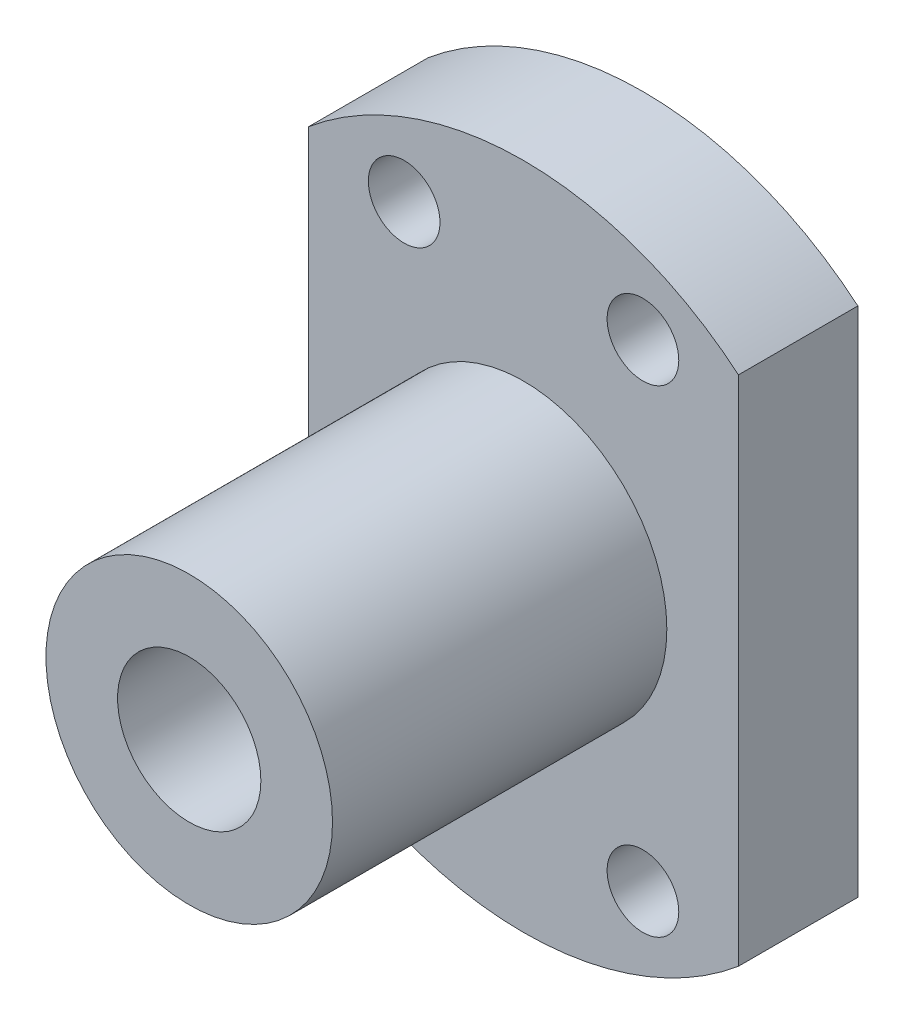
ISO-10303-21;
HEADER;
FILE_DESCRIPTION(('STEP AP214'),'2;1');
FILE_NAME('part.step','',(''),(''),'','','');
FILE_SCHEMA(('AUTOMOTIVE_DESIGN { 1 0 10303 214 1 1 1 1 }'));
ENDSEC;
DATA;
#1=APPLICATION_CONTEXT('core data for automotive mechanical design processes');
#2=APPLICATION_PROTOCOL_DEFINITION('international standard','automotive_design',2000,#1);
#3=PRODUCT_CONTEXT('',#1,'mechanical');
#4=PRODUCT('Part','Part','',(#3));
#5=PRODUCT_RELATED_PRODUCT_CATEGORY('part','',(#4));
#6=PRODUCT_DEFINITION_FORMATION('','',#4);
#7=PRODUCT_DEFINITION_CONTEXT('part definition',#1,'design');
#8=PRODUCT_DEFINITION('design','',#6,#7);
#9=PRODUCT_DEFINITION_SHAPE('','',#8);
#10=(LENGTH_UNIT() NAMED_UNIT(*) SI_UNIT(.MILLI.,.METRE.));
#11=(NAMED_UNIT(*) PLANE_ANGLE_UNIT() SI_UNIT($,.RADIAN.));
#12=(NAMED_UNIT(*) SI_UNIT($,.STERADIAN.) SOLID_ANGLE_UNIT());
#13=UNCERTAINTY_MEASURE_WITH_UNIT(LENGTH_MEASURE(1.E-05),#10,'distance_accuracy_value','');
#14=(GEOMETRIC_REPRESENTATION_CONTEXT(3) GLOBAL_UNCERTAINTY_ASSIGNED_CONTEXT((#13)) GLOBAL_UNIT_ASSIGNED_CONTEXT((#10,
#11,#12)) REPRESENTATION_CONTEXT('',''));
#15=CARTESIAN_POINT('',(0.,0.,0.));
#16=DIRECTION('',(0.,0.,1.));
#17=DIRECTION('',(1.,0.,0.));
#18=AXIS2_PLACEMENT_3D('',#15,#16,#17);
#19=CARTESIAN_POINT('',(0.,0.,5.));
#20=DIRECTION('',(0.,0.,1.));
#21=DIRECTION('',(1.,0.,0.));
#22=AXIS2_PLACEMENT_3D('',#19,#20,#21);
#23=PLANE('',#22);
#24=CARTESIAN_POINT('',(5.,-10.,5.));
#25=DIRECTION('',(0.,0.,1.));
#26=DIRECTION('',(1.,0.,0.));
#27=AXIS2_PLACEMENT_3D('',#24,#25,#26);
#28=CIRCLE('',#27,1.5);
#29=CARTESIAN_POINT('',(6.5,-10.,5.));
#30=VERTEX_POINT('',#29);
#31=EDGE_CURVE('E129',#30,#30,#28,.T.);
#32=ORIENTED_EDGE('',*,*,#31,.F.);
#33=EDGE_LOOP('',(#32));
#34=FACE_BOUND('',#33,.T.);
#35=CARTESIAN_POINT('',(5.,10.,5.));
#36=DIRECTION('',(0.,0.,1.));
#37=DIRECTION('',(1.,0.,0.));
#38=AXIS2_PLACEMENT_3D('',#35,#36,#37);
#39=CIRCLE('',#38,1.5);
#40=CARTESIAN_POINT('',(6.5,10.,5.));
#41=VERTEX_POINT('',#40);
#42=EDGE_CURVE('E117',#41,#41,#39,.T.);
#43=ORIENTED_EDGE('',*,*,#42,.F.);
#44=EDGE_LOOP('',(#43));
#45=FACE_BOUND('',#44,.T.);
#46=CARTESIAN_POINT('',(0.,0.,5.));
#47=DIRECTION('',(0.,0.,1.));
#48=DIRECTION('',(1.,0.,0.));
#49=AXIS2_PLACEMENT_3D('',#46,#47,#48);
#50=CIRCLE('',#49,14.);
#51=CARTESIAN_POINT('',(9.,10.7238052947636,5.));
#52=VERTEX_POINT('',#51);
#53=CARTESIAN_POINT('',(-9.,10.7238052947636,5.));
#54=VERTEX_POINT('',#53);
#55=EDGE_CURVE('E84',#52,#54,#50,.T.);
#56=ORIENTED_EDGE('',*,*,#55,.T.);
#57=DIRECTION('',(0.,-1.,0.));
#58=VECTOR('',#57,1.);
#59=CARTESIAN_POINT('',(-9.,10.7238052947636,5.));
#60=LINE('',#59,#58);
#61=CARTESIAN_POINT('',(-9.,-10.7238052947636,5.));
#62=VERTEX_POINT('',#61);
#63=EDGE_CURVE('E79',#54,#62,#60,.T.);
#64=ORIENTED_EDGE('',*,*,#63,.T.);
#65=CARTESIAN_POINT('',(0.,0.,5.));
#66=DIRECTION('',(0.,0.,1.));
#67=DIRECTION('',(1.,0.,0.));
#68=AXIS2_PLACEMENT_3D('',#65,#66,#67);
#69=CIRCLE('',#68,14.);
#70=CARTESIAN_POINT('',(9.,-10.7238052947636,5.));
#71=VERTEX_POINT('',#70);
#72=EDGE_CURVE('E82',#62,#71,#69,.T.);
#73=ORIENTED_EDGE('',*,*,#72,.T.);
#74=DIRECTION('',(0.,1.,0.));
#75=VECTOR('',#74,1.);
#76=CARTESIAN_POINT('',(9.,10.7238052947636,5.));
#77=LINE('',#76,#75);
#78=EDGE_CURVE('E49',#71,#52,#77,.T.);
#79=ORIENTED_EDGE('',*,*,#78,.T.);
#80=EDGE_LOOP('',(#56,#64,#73,#79));
#81=FACE_BOUND('',#80,.T.);
#82=CARTESIAN_POINT('',(-5.,10.,5.));
#83=DIRECTION('',(0.,0.,1.));
#84=DIRECTION('',(1.,0.,0.));
#85=AXIS2_PLACEMENT_3D('',#82,#83,#84);
#86=CIRCLE('',#85,1.5);
#87=CARTESIAN_POINT('',(-3.5,10.,5.));
#88=VERTEX_POINT('',#87);
#89=EDGE_CURVE('E113',#88,#88,#86,.T.);
#90=ORIENTED_EDGE('',*,*,#89,.F.);
#91=EDGE_LOOP('',(#90));
#92=FACE_BOUND('',#91,.T.);
#93=CARTESIAN_POINT('',(-5.,-10.,5.));
#94=DIRECTION('',(0.,0.,1.));
#95=DIRECTION('',(1.,0.,0.));
#96=AXIS2_PLACEMENT_3D('',#93,#94,#95);
#97=CIRCLE('',#96,1.5);
#98=CARTESIAN_POINT('',(-3.5,-10.,5.));
#99=VERTEX_POINT('',#98);
#100=EDGE_CURVE('E123',#99,#99,#97,.T.);
#101=ORIENTED_EDGE('',*,*,#100,.F.);
#102=EDGE_LOOP('',(#101));
#103=FACE_BOUND('',#102,.T.);
#104=CARTESIAN_POINT('',(0.,0.,5.));
#105=DIRECTION('',(0.,0.,1.));
#106=DIRECTION('',(1.,0.,0.));
#107=AXIS2_PLACEMENT_3D('',#104,#105,#106);
#108=CIRCLE('',#107,6.);
#109=CARTESIAN_POINT('',(6.,0.,5.));
#110=VERTEX_POINT('',#109);
#111=EDGE_CURVE('E138',#110,#110,#108,.T.);
#112=ORIENTED_EDGE('',*,*,#111,.F.);
#113=EDGE_LOOP('',(#112));
#114=FACE_BOUND('',#113,.T.);
#115=ADVANCED_FACE('F32',(#34,#45,#81,#92,#103,#114),#23,.T.);
#116=CARTESIAN_POINT('',(0.,0.,0.));
#117=DIRECTION('',(0.,0.,1.));
#118=DIRECTION('',(1.,0.,0.));
#119=AXIS2_PLACEMENT_3D('',#116,#117,#118);
#120=PLANE('',#119);
#121=CARTESIAN_POINT('',(0.,0.,0.));
#122=DIRECTION('',(0.,0.,1.));
#123=DIRECTION('',(1.,0.,0.));
#124=AXIS2_PLACEMENT_3D('',#121,#122,#123);
#125=CIRCLE('',#124,14.);
#126=CARTESIAN_POINT('',(9.,10.7238052947636,0.));
#127=VERTEX_POINT('',#126);
#128=CARTESIAN_POINT('',(-9.,10.7238052947636,0.));
#129=VERTEX_POINT('',#128);
#130=EDGE_CURVE('E96',#127,#129,#125,.T.);
#131=ORIENTED_EDGE('',*,*,#130,.F.);
#132=DIRECTION('',(0.,1.,0.));
#133=VECTOR('',#132,1.);
#134=CARTESIAN_POINT('',(9.,10.7238052947636,0.));
#135=LINE('',#134,#133);
#136=CARTESIAN_POINT('',(9.,-10.7238052947636,0.));
#137=VERTEX_POINT('',#136);
#138=EDGE_CURVE('E72',#137,#127,#135,.T.);
#139=ORIENTED_EDGE('',*,*,#138,.F.);
#140=CARTESIAN_POINT('',(0.,0.,0.));
#141=DIRECTION('',(0.,0.,1.));
#142=DIRECTION('',(1.,0.,0.));
#143=AXIS2_PLACEMENT_3D('',#140,#141,#142);
#144=CIRCLE('',#143,14.);
#145=CARTESIAN_POINT('',(-9.,-10.7238052947636,0.));
#146=VERTEX_POINT('',#145);
#147=EDGE_CURVE('E66',#146,#137,#144,.T.);
#148=ORIENTED_EDGE('',*,*,#147,.F.);
#149=DIRECTION('',(0.,-1.,0.));
#150=VECTOR('',#149,1.);
#151=CARTESIAN_POINT('',(-9.,10.7238052947636,0.));
#152=LINE('',#151,#150);
#153=EDGE_CURVE('E88',#129,#146,#152,.T.);
#154=ORIENTED_EDGE('',*,*,#153,.F.);
#155=EDGE_LOOP('',(#131,#139,#148,#154));
#156=FACE_BOUND('',#155,.T.);
#157=CARTESIAN_POINT('',(0.,0.,0.));
#158=DIRECTION('',(0.,0.,1.));
#159=DIRECTION('',(1.,0.,0.));
#160=AXIS2_PLACEMENT_3D('',#157,#158,#159);
#161=CIRCLE('',#160,3.);
#162=CARTESIAN_POINT('',(3.,0.,0.));
#163=VERTEX_POINT('',#162);
#164=EDGE_CURVE('E99',#163,#163,#161,.T.);
#165=ORIENTED_EDGE('',*,*,#164,.T.);
#166=EDGE_LOOP('',(#165));
#167=FACE_BOUND('',#166,.T.);
#168=CARTESIAN_POINT('',(-5.,10.,0.));
#169=DIRECTION('',(0.,0.,1.));
#170=DIRECTION('',(1.,0.,0.));
#171=AXIS2_PLACEMENT_3D('',#168,#169,#170);
#172=CIRCLE('',#171,1.5);
#173=CARTESIAN_POINT('',(-3.5,10.,0.));
#174=VERTEX_POINT('',#173);
#175=EDGE_CURVE('E114',#174,#174,#172,.T.);
#176=ORIENTED_EDGE('',*,*,#175,.T.);
#177=EDGE_LOOP('',(#176));
#178=FACE_BOUND('',#177,.T.);
#179=CARTESIAN_POINT('',(5.,10.,0.));
#180=DIRECTION('',(0.,0.,1.));
#181=DIRECTION('',(1.,0.,0.));
#182=AXIS2_PLACEMENT_3D('',#179,#180,#181);
#183=CIRCLE('',#182,1.5);
#184=CARTESIAN_POINT('',(6.5,10.,0.));
#185=VERTEX_POINT('',#184);
#186=EDGE_CURVE('E120',#185,#185,#183,.T.);
#187=ORIENTED_EDGE('',*,*,#186,.T.);
#188=EDGE_LOOP('',(#187));
#189=FACE_BOUND('',#188,.T.);
#190=CARTESIAN_POINT('',(-5.,-10.,0.));
#191=DIRECTION('',(0.,0.,1.));
#192=DIRECTION('',(1.,0.,0.));
#193=AXIS2_PLACEMENT_3D('',#190,#191,#192);
#194=CIRCLE('',#193,1.5);
#195=CARTESIAN_POINT('',(-3.5,-10.,0.));
#196=VERTEX_POINT('',#195);
#197=EDGE_CURVE('E126',#196,#196,#194,.T.);
#198=ORIENTED_EDGE('',*,*,#197,.T.);
#199=EDGE_LOOP('',(#198));
#200=FACE_BOUND('',#199,.T.);
#201=CARTESIAN_POINT('',(5.,-10.,0.));
#202=DIRECTION('',(0.,0.,1.));
#203=DIRECTION('',(1.,0.,0.));
#204=AXIS2_PLACEMENT_3D('',#201,#202,#203);
#205=CIRCLE('',#204,1.5);
#206=CARTESIAN_POINT('',(6.5,-10.,0.));
#207=VERTEX_POINT('',#206);
#208=EDGE_CURVE('E132',#207,#207,#205,.T.);
#209=ORIENTED_EDGE('',*,*,#208,.T.);
#210=EDGE_LOOP('',(#209));
#211=FACE_BOUND('',#210,.T.);
#212=ADVANCED_FACE('F107',(#156,#167,#178,#189,#200,#211),#120,.F.);
#213=CARTESIAN_POINT('',(0.,0.,5.));
#214=DIRECTION('',(0.,0.,-1.));
#215=DIRECTION('',(-1.,0.,0.));
#216=AXIS2_PLACEMENT_3D('',#213,#214,#215);
#217=CYLINDRICAL_SURFACE('',#216,14.);
#218=ORIENTED_EDGE('',*,*,#130,.T.);
#219=DIRECTION('',(0.,0.,-1.));
#220=VECTOR('',#219,1.);
#221=CARTESIAN_POINT('',(-9.,10.7238052947636,5.));
#222=LINE('',#221,#220);
#223=EDGE_CURVE('E11',#54,#129,#222,.T.);
#224=ORIENTED_EDGE('',*,*,#223,.F.);
#225=ORIENTED_EDGE('',*,*,#55,.F.);
#226=DIRECTION('',(0.,0.,-1.));
#227=VECTOR('',#226,1.);
#228=CARTESIAN_POINT('',(9.,10.7238052947636,5.));
#229=LINE('',#228,#227);
#230=EDGE_CURVE('E92',#52,#127,#229,.T.);
#231=ORIENTED_EDGE('',*,*,#230,.T.);
#232=EDGE_LOOP('',(#218,#224,#225,#231));
#233=FACE_BOUND('',#232,.T.);
#234=ADVANCED_FACE('F34',(#233),#217,.T.);
#235=CARTESIAN_POINT('',(-9.,10.7238052947636,5.));
#236=DIRECTION('',(1.,0.,0.));
#237=DIRECTION('',(0.,0.,-1.));
#238=AXIS2_PLACEMENT_3D('',#235,#236,#237);
#239=PLANE('',#238);
#240=ORIENTED_EDGE('',*,*,#153,.T.);
#241=DIRECTION('',(0.,0.,-1.));
#242=VECTOR('',#241,1.);
#243=CARTESIAN_POINT('',(-9.,-10.7238052947636,5.));
#244=LINE('',#243,#242);
#245=EDGE_CURVE('E41',#62,#146,#244,.T.);
#246=ORIENTED_EDGE('',*,*,#245,.F.);
#247=ORIENTED_EDGE('',*,*,#63,.F.);
#248=ORIENTED_EDGE('',*,*,#223,.T.);
#249=EDGE_LOOP('',(#240,#246,#247,#248));
#250=FACE_BOUND('',#249,.T.);
#251=ADVANCED_FACE('F87',(#250),#239,.F.);
#252=CARTESIAN_POINT('',(0.,0.,5.));
#253=DIRECTION('',(0.,0.,-1.));
#254=DIRECTION('',(-1.,0.,0.));
#255=AXIS2_PLACEMENT_3D('',#252,#253,#254);
#256=CYLINDRICAL_SURFACE('',#255,14.);
#257=ORIENTED_EDGE('',*,*,#147,.T.);
#258=DIRECTION('',(0.,0.,-1.));
#259=VECTOR('',#258,1.);
#260=CARTESIAN_POINT('',(9.,-10.7238052947636,5.));
#261=LINE('',#260,#259);
#262=EDGE_CURVE('E89',#71,#137,#261,.T.);
#263=ORIENTED_EDGE('',*,*,#262,.F.);
#264=ORIENTED_EDGE('',*,*,#72,.F.);
#265=ORIENTED_EDGE('',*,*,#245,.T.);
#266=EDGE_LOOP('',(#257,#263,#264,#265));
#267=FACE_BOUND('',#266,.T.);
#268=ADVANCED_FACE('F90',(#267),#256,.T.);
#269=CARTESIAN_POINT('',(9.,10.7238052947636,5.));
#270=DIRECTION('',(-1.,0.,0.));
#271=DIRECTION('',(0.,0.,1.));
#272=AXIS2_PLACEMENT_3D('',#269,#270,#271);
#273=PLANE('',#272);
#274=ORIENTED_EDGE('',*,*,#138,.T.);
#275=ORIENTED_EDGE('',*,*,#230,.F.);
#276=ORIENTED_EDGE('',*,*,#78,.F.);
#277=ORIENTED_EDGE('',*,*,#262,.T.);
#278=EDGE_LOOP('',(#274,#275,#276,#277));
#279=FACE_BOUND('',#278,.T.);
#280=ADVANCED_FACE('F104',(#279),#273,.F.);
#281=CARTESIAN_POINT('',(0.,0.,5.));
#282=DIRECTION('',(0.,0.,-1.));
#283=DIRECTION('',(-1.,0.,0.));
#284=AXIS2_PLACEMENT_3D('',#281,#282,#283);
#285=CYLINDRICAL_SURFACE('',#284,3.);
#286=ORIENTED_EDGE('',*,*,#164,.F.);
#287=EDGE_LOOP('',(#286));
#288=FACE_BOUND('',#287,.T.);
#289=CARTESIAN_POINT('',(0.,0.,19.));
#290=DIRECTION('',(0.,0.,1.));
#291=DIRECTION('',(1.,0.,0.));
#292=AXIS2_PLACEMENT_3D('',#289,#290,#291);
#293=CIRCLE('',#292,3.);
#294=CARTESIAN_POINT('',(3.,0.,19.));
#295=VERTEX_POINT('',#294);
#296=EDGE_CURVE('E141',#295,#295,#293,.T.);
#297=ORIENTED_EDGE('',*,*,#296,.T.);
#298=EDGE_LOOP('',(#297));
#299=FACE_BOUND('',#298,.T.);
#300=ADVANCED_FACE('F147',(#288,#299),#285,.F.);
#301=CARTESIAN_POINT('',(-5.,10.,5.));
#302=DIRECTION('',(0.,0.,-1.));
#303=DIRECTION('',(-1.,0.,0.));
#304=AXIS2_PLACEMENT_3D('',#301,#302,#303);
#305=CYLINDRICAL_SURFACE('',#304,1.5);
#306=ORIENTED_EDGE('',*,*,#89,.T.);
#307=EDGE_LOOP('',(#306));
#308=FACE_BOUND('',#307,.T.);
#309=ORIENTED_EDGE('',*,*,#175,.F.);
#310=EDGE_LOOP('',(#309));
#311=FACE_BOUND('',#310,.T.);
#312=ADVANCED_FACE('F218',(#308,#311),#305,.F.);
#313=CARTESIAN_POINT('',(5.,10.,5.));
#314=DIRECTION('',(0.,0.,-1.));
#315=DIRECTION('',(-1.,0.,0.));
#316=AXIS2_PLACEMENT_3D('',#313,#314,#315);
#317=CYLINDRICAL_SURFACE('',#316,1.5);
#318=ORIENTED_EDGE('',*,*,#42,.T.);
#319=EDGE_LOOP('',(#318));
#320=FACE_BOUND('',#319,.T.);
#321=ORIENTED_EDGE('',*,*,#186,.F.);
#322=EDGE_LOOP('',(#321));
#323=FACE_BOUND('',#322,.T.);
#324=ADVANCED_FACE('F227',(#320,#323),#317,.F.);
#325=CARTESIAN_POINT('',(-5.,-10.,5.));
#326=DIRECTION('',(0.,0.,-1.));
#327=DIRECTION('',(-1.,0.,0.));
#328=AXIS2_PLACEMENT_3D('',#325,#326,#327);
#329=CYLINDRICAL_SURFACE('',#328,1.5);
#330=ORIENTED_EDGE('',*,*,#100,.T.);
#331=EDGE_LOOP('',(#330));
#332=FACE_BOUND('',#331,.T.);
#333=ORIENTED_EDGE('',*,*,#197,.F.);
#334=EDGE_LOOP('',(#333));
#335=FACE_BOUND('',#334,.T.);
#336=ADVANCED_FACE('F162',(#332,#335),#329,.F.);
#337=CARTESIAN_POINT('',(5.,-10.,5.));
#338=DIRECTION('',(0.,0.,-1.));
#339=DIRECTION('',(-1.,0.,0.));
#340=AXIS2_PLACEMENT_3D('',#337,#338,#339);
#341=CYLINDRICAL_SURFACE('',#340,1.5);
#342=ORIENTED_EDGE('',*,*,#31,.T.);
#343=EDGE_LOOP('',(#342));
#344=FACE_BOUND('',#343,.T.);
#345=ORIENTED_EDGE('',*,*,#208,.F.);
#346=EDGE_LOOP('',(#345));
#347=FACE_BOUND('',#346,.T.);
#348=ADVANCED_FACE('F152',(#344,#347),#341,.F.);
#349=CARTESIAN_POINT('',(0.,0.,19.));
#350=DIRECTION('',(0.,0.,1.));
#351=DIRECTION('',(1.,0.,0.));
#352=AXIS2_PLACEMENT_3D('',#349,#350,#351);
#353=PLANE('',#352);
#354=CARTESIAN_POINT('',(0.,0.,19.));
#355=DIRECTION('',(0.,0.,1.));
#356=DIRECTION('',(1.,0.,0.));
#357=AXIS2_PLACEMENT_3D('',#354,#355,#356);
#358=CIRCLE('',#357,6.);
#359=CARTESIAN_POINT('',(6.,0.,19.));
#360=VERTEX_POINT('',#359);
#361=EDGE_CURVE('E135',#360,#360,#358,.T.);
#362=ORIENTED_EDGE('',*,*,#361,.T.);
#363=EDGE_LOOP('',(#362));
#364=FACE_BOUND('',#363,.T.);
#365=ORIENTED_EDGE('',*,*,#296,.F.);
#366=EDGE_LOOP('',(#365));
#367=FACE_BOUND('',#366,.T.);
#368=ADVANCED_FACE('F149',(#364,#367),#353,.T.);
#369=CARTESIAN_POINT('',(0.,0.,19.));
#370=DIRECTION('',(0.,0.,-1.));
#371=DIRECTION('',(-1.,0.,0.));
#372=AXIS2_PLACEMENT_3D('',#369,#370,#371);
#373=CYLINDRICAL_SURFACE('',#372,6.);
#374=ORIENTED_EDGE('',*,*,#361,.F.);
#375=EDGE_LOOP('',(#374));
#376=FACE_BOUND('',#375,.T.);
#377=ORIENTED_EDGE('',*,*,#111,.T.);
#378=EDGE_LOOP('',(#377));
#379=FACE_BOUND('',#378,.T.);
#380=ADVANCED_FACE('F151',(#376,#379),#373,.T.);
#381=CLOSED_SHELL('',(#115,#212,#234,#251,#268,#280,#300,#312,#324,#336,#348,#368,#380));
#382=MANIFOLD_SOLID_BREP('B2',#381);
#383=ADVANCED_BREP_SHAPE_REPRESENTATION('',(#18,#382),#14);
#384=SHAPE_DEFINITION_REPRESENTATION(#9,#383);
ENDSEC;
END-ISO-10303-21;
